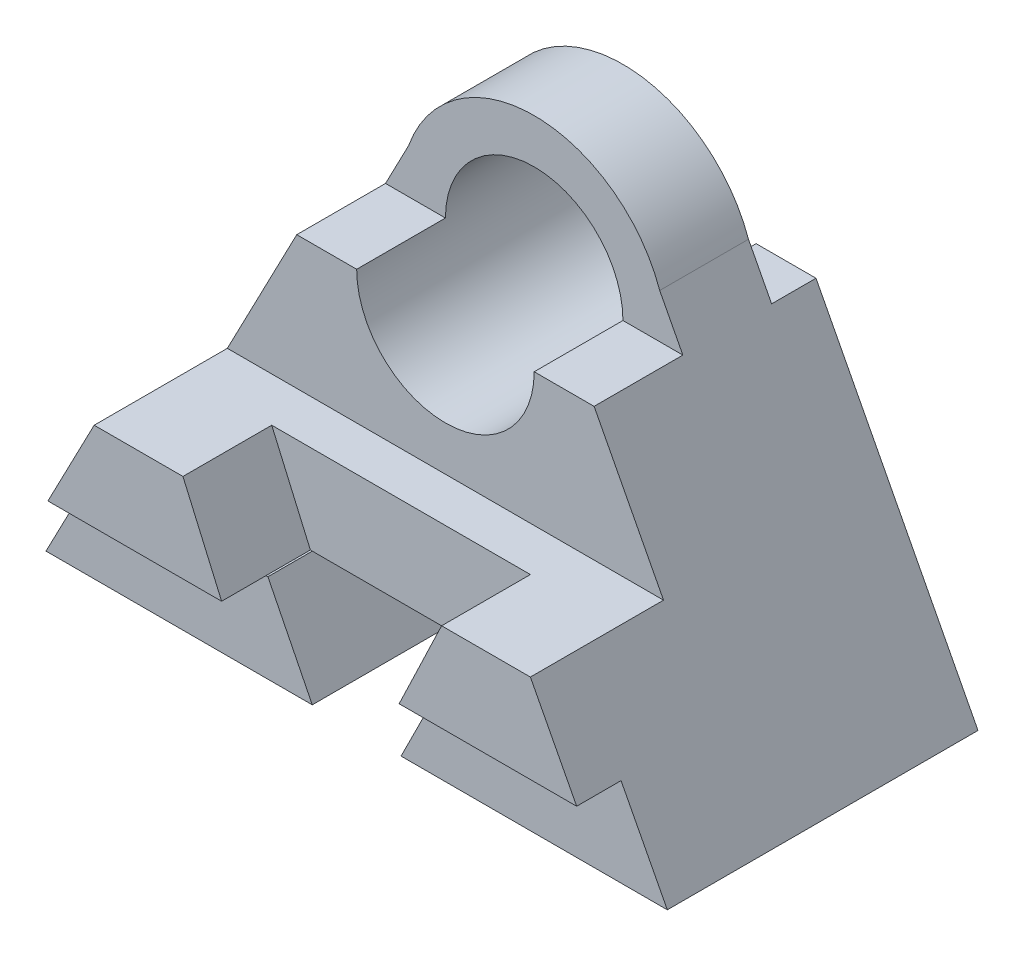
ISO-10303-21;
HEADER;
FILE_DESCRIPTION(('STEP AP214'),'2;1');
FILE_NAME('part.step','',(''),(''),'','','');
FILE_SCHEMA(('AUTOMOTIVE_DESIGN { 1 0 10303 214 1 1 1 1 }'));
ENDSEC;
DATA;
#1=APPLICATION_CONTEXT('core data for automotive mechanical design processes');
#2=APPLICATION_PROTOCOL_DEFINITION('international standard','automotive_design',2000,#1);
#3=PRODUCT_CONTEXT('',#1,'mechanical');
#4=PRODUCT('Part','Part','',(#3));
#5=PRODUCT_RELATED_PRODUCT_CATEGORY('part','',(#4));
#6=PRODUCT_DEFINITION_FORMATION('','',#4);
#7=PRODUCT_DEFINITION_CONTEXT('part definition',#1,'design');
#8=PRODUCT_DEFINITION('design','',#6,#7);
#9=PRODUCT_DEFINITION_SHAPE('','',#8);
#10=(LENGTH_UNIT() NAMED_UNIT(*) SI_UNIT(.MILLI.,.METRE.));
#11=(NAMED_UNIT(*) PLANE_ANGLE_UNIT() SI_UNIT($,.RADIAN.));
#12=(NAMED_UNIT(*) SI_UNIT($,.STERADIAN.) SOLID_ANGLE_UNIT());
#13=UNCERTAINTY_MEASURE_WITH_UNIT(LENGTH_MEASURE(1.E-05),#10,'distance_accuracy_value','');
#14=(GEOMETRIC_REPRESENTATION_CONTEXT(3) GLOBAL_UNCERTAINTY_ASSIGNED_CONTEXT((#13)) GLOBAL_UNIT_ASSIGNED_CONTEXT((#10,
#11,#12)) REPRESENTATION_CONTEXT('',''));
#15=CARTESIAN_POINT('',(0.,0.,0.));
#16=DIRECTION('',(0.,0.,1.));
#17=DIRECTION('',(1.,0.,0.));
#18=AXIS2_PLACEMENT_3D('',#15,#16,#17);
#19=CARTESIAN_POINT('',(-14.,2.,8.));
#20=DIRECTION('',(0.,-1.,0.));
#21=DIRECTION('',(0.,0.,-1.));
#22=AXIS2_PLACEMENT_3D('',#19,#20,#21);
#23=PLANE('',#22);
#24=DIRECTION('',(0.,0.,1.));
#25=VECTOR('',#24,1.);
#26=CARTESIAN_POINT('',(-9.04289321881345,2.,6.));
#27=LINE('',#26,#25);
#28=CARTESIAN_POINT('',(-9.04289321881345,2.,7.));
#29=VERTEX_POINT('',#28);
#30=CARTESIAN_POINT('',(-9.04289321881345,2.,8.));
#31=VERTEX_POINT('',#30);
#32=EDGE_CURVE('E377',#29,#31,#27,.T.);
#33=ORIENTED_EDGE('',*,*,#32,.T.);
#34=DIRECTION('',(1.,0.,0.));
#35=VECTOR('',#34,1.);
#36=CARTESIAN_POINT('',(-14.,2.,8.));
#37=LINE('',#36,#35);
#38=CARTESIAN_POINT('',(-12.9571067811865,2.,8.));
#39=VERTEX_POINT('',#38);
#40=EDGE_CURVE('E486',#39,#31,#37,.T.);
#41=ORIENTED_EDGE('',*,*,#40,.F.);
#42=DIRECTION('',(0.,0.,1.));
#43=VECTOR('',#42,1.);
#44=CARTESIAN_POINT('',(-12.9571067811865,2.,8.));
#45=LINE('',#44,#43);
#46=CARTESIAN_POINT('',(-12.9571067811865,2.,7.));
#47=VERTEX_POINT('',#46);
#48=EDGE_CURVE('E402',#47,#39,#45,.T.);
#49=ORIENTED_EDGE('',*,*,#48,.F.);
#50=DIRECTION('',(1.,0.,0.));
#51=VECTOR('',#50,1.);
#52=CARTESIAN_POINT('',(-14.,2.,7.));
#53=LINE('',#52,#51);
#54=EDGE_CURVE('E482',#47,#29,#53,.T.);
#55=ORIENTED_EDGE('',*,*,#54,.T.);
#56=EDGE_LOOP('',(#33,#41,#49,#55));
#57=FACE_BOUND('',#56,.T.);
#58=ADVANCED_FACE('F183',(#57),#23,.T.);
#59=CARTESIAN_POINT('',(-14.,4.,8.));
#60=DIRECTION('',(0.,0.,1.));
#61=DIRECTION('',(1.,0.,0.));
#62=AXIS2_PLACEMENT_3D('',#59,#60,#61);
#63=PLANE('',#62);
#64=DIRECTION('',(0.431670229113991,0.902031492408483,0.));
#65=VECTOR('',#64,1.);
#66=CARTESIAN_POINT('',(-5.04289321881345,2.,8.));
#67=LINE('',#66,#65);
#68=CARTESIAN_POINT('',(-5.04289321881345,2.,8.));
#69=VERTEX_POINT('',#68);
#70=CARTESIAN_POINT('',(-4.0857864376269,4.,8.));
#71=VERTEX_POINT('',#70);
#72=EDGE_CURVE('E370',#69,#71,#67,.T.);
#73=ORIENTED_EDGE('',*,*,#72,.F.);
#74=CARTESIAN_POINT('',(-1.04289321881345,2.,8.));
#75=VERTEX_POINT('',#74);
#76=EDGE_CURVE('E489',#69,#75,#37,.T.);
#77=ORIENTED_EDGE('',*,*,#76,.T.);
#78=DIRECTION('',(0.462362116591506,-0.886691193787906,0.));
#79=VECTOR('',#78,1.);
#80=CARTESIAN_POINT('',(0.,0.,8.));
#81=LINE('',#80,#79);
#82=CARTESIAN_POINT('',(-2.0857864376269,4.,8.));
#83=VERTEX_POINT('',#82);
#84=EDGE_CURVE('E425',#83,#75,#81,.T.);
#85=ORIENTED_EDGE('',*,*,#84,.F.);
#86=DIRECTION('',(1.,0.,0.));
#87=VECTOR('',#86,1.);
#88=CARTESIAN_POINT('',(-14.,4.,8.));
#89=LINE('',#88,#87);
#90=EDGE_CURVE('E491',#71,#83,#89,.T.);
#91=ORIENTED_EDGE('',*,*,#90,.F.);
#92=EDGE_LOOP('',(#73,#77,#85,#91));
#93=FACE_BOUND('',#92,.T.);
#94=ADVANCED_FACE('F559',(#93),#63,.T.);
#95=CARTESIAN_POINT('',(-14.,10.,3.));
#96=DIRECTION('',(0.,0.,1.));
#97=DIRECTION('',(0.,-1.,0.));
#98=AXIS2_PLACEMENT_3D('',#95,#96,#97);
#99=PLANE('',#98);
#100=DIRECTION('',(0.462362116591506,0.886691193787906,0.));
#101=VECTOR('',#100,1.);
#102=CARTESIAN_POINT('',(-9.90027582877174,7.86221273141022,3.));
#103=LINE('',#102,#101);
#104=CARTESIAN_POINT('',(-10.3498737341529,7.,3.));
#105=VERTEX_POINT('',#104);
#106=CARTESIAN_POINT('',(-9.82842712474619,8.,3.));
#107=VERTEX_POINT('',#106);
#108=EDGE_CURVE('E399',#105,#107,#103,.T.);
#109=ORIENTED_EDGE('',*,*,#108,.F.);
#110=DIRECTION('',(1.,0.,0.));
#111=VECTOR('',#110,1.);
#112=CARTESIAN_POINT('',(-14.,7.,3.));
#113=LINE('',#112,#111);
#114=CARTESIAN_POINT('',(-9.,7.,3.));
#115=VERTEX_POINT('',#114);
#116=EDGE_CURVE('E497',#105,#115,#113,.T.);
#117=ORIENTED_EDGE('',*,*,#116,.T.);
#118=CARTESIAN_POINT('',(-7.,7.,3.));
#119=DIRECTION('',(0.,0.,1.));
#120=DIRECTION('',(0.,-1.,0.));
#121=AXIS2_PLACEMENT_3D('',#118,#119,#120);
#122=CIRCLE('',#121,2.);
#123=CARTESIAN_POINT('',(-5.,7.,3.));
#124=VERTEX_POINT('',#123);
#125=EDGE_CURVE('E455',#124,#115,#122,.T.);
#126=ORIENTED_EDGE('',*,*,#125,.F.);
#127=CARTESIAN_POINT('',(-3.65012626584708,7.,3.));
#128=VERTEX_POINT('',#127);
#129=EDGE_CURVE('E499',#124,#128,#113,.T.);
#130=ORIENTED_EDGE('',*,*,#129,.T.);
#131=DIRECTION('',(0.462362116591506,-0.886691193787906,0.));
#132=VECTOR('',#131,1.);
#133=CARTESIAN_POINT('',(-7.09262634725394,13.6018265711298,3.));
#134=LINE('',#133,#132);
#135=CARTESIAN_POINT('',(-4.17157287525381,8.,3.));
#136=VERTEX_POINT('',#135);
#137=EDGE_CURVE('E434',#136,#128,#134,.T.);
#138=ORIENTED_EDGE('',*,*,#137,.F.);
#139=CARTESIAN_POINT('',(-7.,7.,3.));
#140=DIRECTION('',(0.,0.,1.));
#141=DIRECTION('',(0.,-1.,0.));
#142=AXIS2_PLACEMENT_3D('',#139,#140,#141);
#143=CIRCLE('',#142,3.);
#144=EDGE_CURVE('E469',#107,#136,#143,.F.);
#145=ORIENTED_EDGE('',*,*,#144,.F.);
#146=EDGE_LOOP('',(#109,#117,#126,#130,#138,#145));
#147=FACE_BOUND('',#146,.T.);
#148=ADVANCED_FACE('F581',(#147),#99,.T.);
#149=CARTESIAN_POINT('',(-14.,7.,1.));
#150=DIRECTION('',(0.,0.,-1.));
#151=DIRECTION('',(-1.,0.,0.));
#152=AXIS2_PLACEMENT_3D('',#149,#150,#151);
#153=PLANE('',#152);
#154=DIRECTION('',(-0.462362116591506,-0.886691193787906,0.));
#155=VECTOR('',#154,1.);
#156=CARTESIAN_POINT('',(-11.1301930801402,5.50354891198716,1.));
#157=LINE('',#156,#155);
#158=CARTESIAN_POINT('',(-9.82842712474619,8.,1.));
#159=VERTEX_POINT('',#158);
#160=CARTESIAN_POINT('',(-10.3498737341529,7.,1.));
#161=VERTEX_POINT('',#160);
#162=EDGE_CURVE('E410',#159,#161,#157,.T.);
#163=ORIENTED_EDGE('',*,*,#162,.F.);
#164=CARTESIAN_POINT('',(-7.,7.,1.));
#165=DIRECTION('',(0.,0.,-1.));
#166=DIRECTION('',(-1.,0.,0.));
#167=AXIS2_PLACEMENT_3D('',#164,#165,#166);
#168=CIRCLE('',#167,3.);
#169=CARTESIAN_POINT('',(-4.17157287525381,8.,1.));
#170=VERTEX_POINT('',#169);
#171=EDGE_CURVE('E12',#170,#159,#168,.F.);
#172=ORIENTED_EDGE('',*,*,#171,.F.);
#173=DIRECTION('',(-0.462362116591506,0.886691193787906,0.));
#174=VECTOR('',#173,1.);
#175=CARTESIAN_POINT('',(-5.86270909588547,11.2431627517067,1.));
#176=LINE('',#175,#174);
#177=CARTESIAN_POINT('',(-3.65012626584709,7.,1.));
#178=VERTEX_POINT('',#177);
#179=EDGE_CURVE('E432',#178,#170,#176,.T.);
#180=ORIENTED_EDGE('',*,*,#179,.F.);
#181=DIRECTION('',(1.,0.,0.));
#182=VECTOR('',#181,1.);
#183=CARTESIAN_POINT('',(-14.,7.,1.));
#184=LINE('',#183,#182);
#185=CARTESIAN_POINT('',(-5.,7.,1.));
#186=VERTEX_POINT('',#185);
#187=EDGE_CURVE('E502',#186,#178,#184,.T.);
#188=ORIENTED_EDGE('',*,*,#187,.F.);
#189=CARTESIAN_POINT('',(-7.,7.,1.));
#190=DIRECTION('',(0.,0.,-1.));
#191=DIRECTION('',(-1.,0.,0.));
#192=AXIS2_PLACEMENT_3D('',#189,#190,#191);
#193=CIRCLE('',#192,2.);
#194=CARTESIAN_POINT('',(-9.,7.,1.));
#195=VERTEX_POINT('',#194);
#196=EDGE_CURVE('E453',#195,#186,#193,.T.);
#197=ORIENTED_EDGE('',*,*,#196,.F.);
#198=EDGE_CURVE('E500',#161,#195,#184,.T.);
#199=ORIENTED_EDGE('',*,*,#198,.F.);
#200=EDGE_LOOP('',(#163,#172,#180,#188,#197,#199));
#201=FACE_BOUND('',#200,.T.);
#202=ADVANCED_FACE('F598',(#201),#153,.T.);
#203=CARTESIAN_POINT('',(-14.,0.,7.));
#204=DIRECTION('',(0.,-1.,0.));
#205=DIRECTION('',(0.,0.,-1.));
#206=AXIS2_PLACEMENT_3D('',#203,#204,#205);
#207=PLANE('',#206);
#208=DIRECTION('',(1.,0.,0.));
#209=VECTOR('',#208,1.);
#210=CARTESIAN_POINT('',(-14.,0.,0.));
#211=LINE('',#210,#209);
#212=CARTESIAN_POINT('',(-14.,0.,0.));
#213=VERTEX_POINT('',#212);
#214=CARTESIAN_POINT('',(-8.,0.,0.));
#215=VERTEX_POINT('',#214);
#216=EDGE_CURVE('E506',#213,#215,#211,.T.);
#217=ORIENTED_EDGE('',*,*,#216,.T.);
#218=DIRECTION('',(0.,0.,1.));
#219=VECTOR('',#218,1.);
#220=CARTESIAN_POINT('',(-8.,0.,-6.));
#221=LINE('',#220,#219);
#222=CARTESIAN_POINT('',(-8.,0.,7.));
#223=VERTEX_POINT('',#222);
#224=EDGE_CURVE('E412',#215,#223,#221,.T.);
#225=ORIENTED_EDGE('',*,*,#224,.T.);
#226=DIRECTION('',(1.,0.,0.));
#227=VECTOR('',#226,1.);
#228=CARTESIAN_POINT('',(-14.,0.,7.));
#229=LINE('',#228,#227);
#230=CARTESIAN_POINT('',(-14.,0.,7.));
#231=VERTEX_POINT('',#230);
#232=EDGE_CURVE('E477',#231,#223,#229,.T.);
#233=ORIENTED_EDGE('',*,*,#232,.F.);
#234=DIRECTION('',(0.,0.,-1.));
#235=VECTOR('',#234,1.);
#236=CARTESIAN_POINT('',(-14.,0.,7.));
#237=LINE('',#236,#235);
#238=EDGE_CURVE('E472',#231,#213,#237,.T.);
#239=ORIENTED_EDGE('',*,*,#238,.T.);
#240=EDGE_LOOP('',(#217,#225,#233,#239));
#241=FACE_BOUND('',#240,.T.);
#242=ADVANCED_FACE('F185',(#241),#207,.T.);
#243=CARTESIAN_POINT('',(-6.,0.,7.));
#244=VERTEX_POINT('',#243);
#245=CARTESIAN_POINT('',(0.,0.,7.));
#246=VERTEX_POINT('',#245);
#247=EDGE_CURVE('E481',#244,#246,#229,.T.);
#248=ORIENTED_EDGE('',*,*,#247,.F.);
#249=DIRECTION('',(0.,0.,1.));
#250=VECTOR('',#249,1.);
#251=CARTESIAN_POINT('',(-6.,0.,-6.));
#252=LINE('',#251,#250);
#253=CARTESIAN_POINT('',(-6.,0.,0.));
#254=VERTEX_POINT('',#253);
#255=EDGE_CURVE('E413',#254,#244,#252,.T.);
#256=ORIENTED_EDGE('',*,*,#255,.F.);
#257=CARTESIAN_POINT('',(0.,0.,0.));
#258=VERTEX_POINT('',#257);
#259=EDGE_CURVE('E475',#254,#258,#211,.T.);
#260=ORIENTED_EDGE('',*,*,#259,.T.);
#261=DIRECTION('',(0.,0.,-1.));
#262=VECTOR('',#261,1.);
#263=CARTESIAN_POINT('',(0.,0.,7.));
#264=LINE('',#263,#262);
#265=EDGE_CURVE('E471',#246,#258,#264,.T.);
#266=ORIENTED_EDGE('',*,*,#265,.F.);
#267=EDGE_LOOP('',(#248,#256,#260,#266));
#268=FACE_BOUND('',#267,.T.);
#269=ADVANCED_FACE('F622',(#268),#207,.T.);
#270=CARTESIAN_POINT('',(-14.,2.,7.));
#271=DIRECTION('',(0.,0.,1.));
#272=DIRECTION('',(1.,0.,0.));
#273=AXIS2_PLACEMENT_3D('',#270,#271,#272);
#274=PLANE('',#273);
#275=DIRECTION('',(0.462362116591506,0.886691193787906,0.));
#276=VECTOR('',#275,1.);
#277=CARTESIAN_POINT('',(-13.1800551657543,1.57244254628204,7.));
#278=LINE('',#277,#276);
#279=EDGE_CURVE('E404',#231,#47,#278,.T.);
#280=ORIENTED_EDGE('',*,*,#279,.F.);
#281=ORIENTED_EDGE('',*,*,#232,.T.);
#282=DIRECTION('',(-0.447213595499958,0.894427190999916,0.));
#283=VECTOR('',#282,1.);
#284=CARTESIAN_POINT('',(-10.,4.,7.));
#285=LINE('',#284,#283);
#286=CARTESIAN_POINT('',(-9.,2.,7.));
#287=VERTEX_POINT('',#286);
#288=EDGE_CURVE('E466',#223,#287,#285,.T.);
#289=ORIENTED_EDGE('',*,*,#288,.T.);
#290=DIRECTION('',(1.,0.,0.));
#291=VECTOR('',#290,1.);
#292=CARTESIAN_POINT('',(-14.,2.,7.));
#293=LINE('',#292,#291);
#294=EDGE_CURVE('E385',#29,#287,#293,.T.);
#295=ORIENTED_EDGE('',*,*,#294,.F.);
#296=ORIENTED_EDGE('',*,*,#54,.F.);
#297=EDGE_LOOP('',(#280,#281,#289,#295,#296));
#298=FACE_BOUND('',#297,.T.);
#299=ADVANCED_FACE('F531',(#298),#274,.T.);
#300=CARTESIAN_POINT('',(-5.,2.,7.));
#301=VERTEX_POINT('',#300);
#302=CARTESIAN_POINT('',(-1.04289321881345,2.,7.));
#303=VERTEX_POINT('',#302);
#304=EDGE_CURVE('E485',#301,#303,#53,.T.);
#305=ORIENTED_EDGE('',*,*,#304,.F.);
#306=DIRECTION('',(-0.447213595499958,-0.894427190999916,0.));
#307=VECTOR('',#306,1.);
#308=CARTESIAN_POINT('',(-6.8,-1.6,7.));
#309=LINE('',#308,#307);
#310=EDGE_CURVE('E463',#301,#244,#309,.T.);
#311=ORIENTED_EDGE('',*,*,#310,.T.);
#312=ORIENTED_EDGE('',*,*,#247,.T.);
#313=DIRECTION('',(0.462362116591506,-0.886691193787906,0.));
#314=VECTOR('',#313,1.);
#315=CARTESIAN_POINT('',(-3.81284701027134,7.31205638600161,7.));
#316=LINE('',#315,#314);
#317=EDGE_CURVE('E446',#303,#246,#316,.T.);
#318=ORIENTED_EDGE('',*,*,#317,.F.);
#319=EDGE_LOOP('',(#305,#311,#312,#318));
#320=FACE_BOUND('',#319,.T.);
#321=ADVANCED_FACE('F627',(#320),#274,.T.);
#322=CARTESIAN_POINT('',(-14.,7.,3.));
#323=DIRECTION('',(0.,1.,0.));
#324=DIRECTION('',(0.,0.,1.));
#325=AXIS2_PLACEMENT_3D('',#322,#323,#324);
#326=PLANE('',#325);
#327=DIRECTION('',(0.,0.,-1.));
#328=VECTOR('',#327,1.);
#329=CARTESIAN_POINT('',(-10.3498737341529,7.,3.));
#330=LINE('',#329,#328);
#331=CARTESIAN_POINT('',(-10.3498737341529,7.,5.));
#332=VERTEX_POINT('',#331);
#333=EDGE_CURVE('E397',#332,#105,#330,.T.);
#334=ORIENTED_EDGE('',*,*,#333,.F.);
#335=DIRECTION('',(1.,0.,0.));
#336=VECTOR('',#335,1.);
#337=CARTESIAN_POINT('',(-14.,7.,5.));
#338=LINE('',#337,#336);
#339=CARTESIAN_POINT('',(-9.,7.,5.));
#340=VERTEX_POINT('',#339);
#341=EDGE_CURVE('E494',#332,#340,#338,.T.);
#342=ORIENTED_EDGE('',*,*,#341,.T.);
#343=DIRECTION('',(0.,0.,1.));
#344=VECTOR('',#343,1.);
#345=CARTESIAN_POINT('',(-9.,7.,-6.));
#346=LINE('',#345,#344);
#347=EDGE_CURVE('E458',#115,#340,#346,.T.);
#348=ORIENTED_EDGE('',*,*,#347,.F.);
#349=ORIENTED_EDGE('',*,*,#116,.F.);
#350=EDGE_LOOP('',(#334,#342,#348,#349));
#351=FACE_BOUND('',#350,.T.);
#352=ADVANCED_FACE('F578',(#351),#326,.T.);
#353=CARTESIAN_POINT('',(-14.,7.,0.));
#354=DIRECTION('',(0.,1.,0.));
#355=DIRECTION('',(0.,0.,1.));
#356=AXIS2_PLACEMENT_3D('',#353,#354,#355);
#357=PLANE('',#356);
#358=DIRECTION('',(0.,0.,-1.));
#359=VECTOR('',#358,1.);
#360=CARTESIAN_POINT('',(-10.3498737341529,7.,0.));
#361=LINE('',#360,#359);
#362=CARTESIAN_POINT('',(-10.3498737341529,7.,0.));
#363=VERTEX_POINT('',#362);
#364=EDGE_CURVE('E408',#161,#363,#361,.T.);
#365=ORIENTED_EDGE('',*,*,#364,.F.);
#366=ORIENTED_EDGE('',*,*,#198,.T.);
#367=DIRECTION('',(0.,0.,1.));
#368=VECTOR('',#367,1.);
#369=CARTESIAN_POINT('',(-9.,7.,-6.));
#370=LINE('',#369,#368);
#371=CARTESIAN_POINT('',(-9.,7.,0.));
#372=VERTEX_POINT('',#371);
#373=EDGE_CURVE('E450',#372,#195,#370,.T.);
#374=ORIENTED_EDGE('',*,*,#373,.F.);
#375=DIRECTION('',(1.,0.,0.));
#376=VECTOR('',#375,1.);
#377=CARTESIAN_POINT('',(-14.,7.,0.));
#378=LINE('',#377,#376);
#379=EDGE_CURVE('E503',#363,#372,#378,.T.);
#380=ORIENTED_EDGE('',*,*,#379,.F.);
#381=EDGE_LOOP('',(#365,#366,#374,#380));
#382=FACE_BOUND('',#381,.T.);
#383=ADVANCED_FACE('F606',(#382),#357,.T.);
#384=CARTESIAN_POINT('',(-14.,0.,0.));
#385=DIRECTION('',(0.,0.,-1.));
#386=DIRECTION('',(-1.,0.,0.));
#387=AXIS2_PLACEMENT_3D('',#384,#385,#386);
#388=PLANE('',#387);
#389=DIRECTION('',(-0.462362116591506,-0.886691193787906,0.));
#390=VECTOR('',#389,1.);
#391=CARTESIAN_POINT('',(-14.,0.,0.));
#392=LINE('',#391,#390);
#393=EDGE_CURVE('E406',#363,#213,#392,.T.);
#394=ORIENTED_EDGE('',*,*,#393,.F.);
#395=ORIENTED_EDGE('',*,*,#379,.T.);
#396=CARTESIAN_POINT('',(-7.,7.,0.));
#397=DIRECTION('',(0.,0.,-1.));
#398=DIRECTION('',(-1.,0.,0.));
#399=AXIS2_PLACEMENT_3D('',#396,#397,#398);
#400=CIRCLE('',#399,2.);
#401=CARTESIAN_POINT('',(-5.,7.,0.));
#402=VERTEX_POINT('',#401);
#403=EDGE_CURVE('E480',#402,#372,#400,.T.);
#404=ORIENTED_EDGE('',*,*,#403,.F.);
#405=CARTESIAN_POINT('',(-3.65012626584708,7.,0.));
#406=VERTEX_POINT('',#405);
#407=EDGE_CURVE('E505',#402,#406,#378,.T.);
#408=ORIENTED_EDGE('',*,*,#407,.T.);
#409=DIRECTION('',(-0.462362116591506,0.886691193787906,0.));
#410=VECTOR('',#409,1.);
#411=CARTESIAN_POINT('',(-2.99290217602569,5.73961383971956,0.));
#412=LINE('',#411,#410);
#413=EDGE_CURVE('E428',#258,#406,#412,.T.);
#414=ORIENTED_EDGE('',*,*,#413,.F.);
#415=ORIENTED_EDGE('',*,*,#259,.F.);
#416=DIRECTION('',(0.447213595499958,0.894427190999916,0.));
#417=VECTOR('',#416,1.);
#418=CARTESIAN_POINT('',(-7.6,-3.2,0.));
#419=LINE('',#418,#417);
#420=CARTESIAN_POINT('',(-5.,2.,0.));
#421=VERTEX_POINT('',#420);
#422=EDGE_CURVE('E511',#254,#421,#419,.T.);
#423=ORIENTED_EDGE('',*,*,#422,.T.);
#424=DIRECTION('',(-1.,0.,0.));
#425=VECTOR('',#424,1.);
#426=CARTESIAN_POINT('',(-14.,2.,0.));
#427=LINE('',#426,#425);
#428=CARTESIAN_POINT('',(-9.,2.,0.));
#429=VERTEX_POINT('',#428);
#430=EDGE_CURVE('E514',#421,#429,#427,.T.);
#431=ORIENTED_EDGE('',*,*,#430,.T.);
#432=DIRECTION('',(0.447213595499958,-0.894427190999916,0.));
#433=VECTOR('',#432,1.);
#434=CARTESIAN_POINT('',(-9.2,2.4,0.));
#435=LINE('',#434,#433);
#436=EDGE_CURVE('E191',#429,#215,#435,.T.);
#437=ORIENTED_EDGE('',*,*,#436,.T.);
#438=ORIENTED_EDGE('',*,*,#216,.F.);
#439=EDGE_LOOP('',(#394,#395,#404,#408,#414,#415,#423,#431,#437,#438));
#440=FACE_BOUND('',#439,.T.);
#441=ADVANCED_FACE('F520',(#440),#388,.T.);
#442=DIRECTION('',(0.,0.,1.));
#443=VECTOR('',#442,1.);
#444=CARTESIAN_POINT('',(-5.04289321881345,2.,6.));
#445=LINE('',#444,#443);
#446=CARTESIAN_POINT('',(-5.04289321881345,2.,6.));
#447=VERTEX_POINT('',#446);
#448=EDGE_CURVE('E543',#447,#69,#445,.T.);
#449=ORIENTED_EDGE('',*,*,#448,.F.);
#450=DIRECTION('',(1.,0.,0.));
#451=VECTOR('',#450,1.);
#452=CARTESIAN_POINT('',(-9.04289321881345,2.,6.));
#453=LINE('',#452,#451);
#454=CARTESIAN_POINT('',(-9.,2.,6.));
#455=VERTEX_POINT('',#454);
#456=EDGE_CURVE('E360',#455,#447,#453,.T.);
#457=ORIENTED_EDGE('',*,*,#456,.F.);
#458=DIRECTION('',(0.,0.,1.));
#459=VECTOR('',#458,1.);
#460=CARTESIAN_POINT('',(-9.,2.,-6.));
#461=LINE('',#460,#459);
#462=EDGE_CURVE('E417',#429,#455,#461,.T.);
#463=ORIENTED_EDGE('',*,*,#462,.F.);
#464=ORIENTED_EDGE('',*,*,#430,.F.);
#465=DIRECTION('',(0.,0.,1.));
#466=VECTOR('',#465,1.);
#467=CARTESIAN_POINT('',(-5.,2.,-6.));
#468=LINE('',#467,#466);
#469=EDGE_CURVE('E206',#421,#301,#468,.T.);
#470=ORIENTED_EDGE('',*,*,#469,.T.);
#471=ORIENTED_EDGE('',*,*,#304,.T.);
#472=DIRECTION('',(0.,0.,-1.));
#473=VECTOR('',#472,1.);
#474=CARTESIAN_POINT('',(-1.04289321881345,2.,8.));
#475=LINE('',#474,#473);
#476=EDGE_CURVE('E444',#75,#303,#475,.T.);
#477=ORIENTED_EDGE('',*,*,#476,.F.);
#478=ORIENTED_EDGE('',*,*,#76,.F.);
#479=EDGE_LOOP('',(#449,#457,#463,#464,#470,#471,#477,#478));
#480=FACE_BOUND('',#479,.T.);
#481=ADVANCED_FACE('F554',(#480),#23,.T.);
#482=DIRECTION('',(0.399402625379115,-0.916775622952678,0.));
#483=VECTOR('',#482,1.);
#484=CARTESIAN_POINT('',(-9.91421356237309,4.,8.));
#485=LINE('',#484,#483);
#486=CARTESIAN_POINT('',(-9.91421356237309,4.,8.));
#487=VERTEX_POINT('',#486);
#488=EDGE_CURVE('E538',#487,#31,#485,.T.);
#489=ORIENTED_EDGE('',*,*,#488,.F.);
#490=CARTESIAN_POINT('',(-11.9142135623731,4.,8.));
#491=VERTEX_POINT('',#490);
#492=EDGE_CURVE('E376',#491,#487,#89,.T.);
#493=ORIENTED_EDGE('',*,*,#492,.F.);
#494=DIRECTION('',(0.462362116591506,0.886691193787906,0.));
#495=VECTOR('',#494,1.);
#496=CARTESIAN_POINT('',(-11.0070978239743,5.73961383971956,8.));
#497=LINE('',#496,#495);
#498=EDGE_CURVE('E387',#39,#491,#497,.T.);
#499=ORIENTED_EDGE('',*,*,#498,.F.);
#500=ORIENTED_EDGE('',*,*,#40,.T.);
#501=EDGE_LOOP('',(#489,#493,#499,#500));
#502=FACE_BOUND('',#501,.T.);
#503=ADVANCED_FACE('F537',(#502),#63,.T.);
#504=CARTESIAN_POINT('',(-14.,4.,5.));
#505=DIRECTION('',(0.,1.,0.));
#506=DIRECTION('',(0.,0.,1.));
#507=AXIS2_PLACEMENT_3D('',#504,#505,#506);
#508=PLANE('',#507);
#509=DIRECTION('',(0.,0.,1.));
#510=VECTOR('',#509,1.);
#511=CARTESIAN_POINT('',(-4.0857864376269,4.,6.));
#512=LINE('',#511,#510);
#513=CARTESIAN_POINT('',(-4.0857864376269,4.,6.));
#514=VERTEX_POINT('',#513);
#515=EDGE_CURVE('E388',#514,#71,#512,.T.);
#516=ORIENTED_EDGE('',*,*,#515,.T.);
#517=ORIENTED_EDGE('',*,*,#90,.T.);
#518=DIRECTION('',(0.,0.,1.));
#519=VECTOR('',#518,1.);
#520=CARTESIAN_POINT('',(-2.08578643762691,4.,5.));
#521=LINE('',#520,#519);
#522=CARTESIAN_POINT('',(-2.0857864376269,4.,5.));
#523=VERTEX_POINT('',#522);
#524=EDGE_CURVE('E441',#523,#83,#521,.T.);
#525=ORIENTED_EDGE('',*,*,#524,.F.);
#526=DIRECTION('',(1.,0.,0.));
#527=VECTOR('',#526,1.);
#528=CARTESIAN_POINT('',(-14.,4.,5.));
#529=LINE('',#528,#527);
#530=CARTESIAN_POINT('',(-11.9142135623731,4.,5.));
#531=VERTEX_POINT('',#530);
#532=EDGE_CURVE('E492',#531,#523,#529,.T.);
#533=ORIENTED_EDGE('',*,*,#532,.F.);
#534=DIRECTION('',(0.,0.,-1.));
#535=VECTOR('',#534,1.);
#536=CARTESIAN_POINT('',(-11.9142135623731,4.,5.));
#537=LINE('',#536,#535);
#538=EDGE_CURVE('E395',#491,#531,#537,.T.);
#539=ORIENTED_EDGE('',*,*,#538,.F.);
#540=ORIENTED_EDGE('',*,*,#492,.T.);
#541=DIRECTION('',(0.,0.,1.));
#542=VECTOR('',#541,1.);
#543=CARTESIAN_POINT('',(-9.91421356237309,4.,6.));
#544=LINE('',#543,#542);
#545=CARTESIAN_POINT('',(-9.91421356237309,4.,6.));
#546=VERTEX_POINT('',#545);
#547=EDGE_CURVE('E353',#546,#487,#544,.T.);
#548=ORIENTED_EDGE('',*,*,#547,.F.);
#549=DIRECTION('',(-1.,0.,0.));
#550=VECTOR('',#549,1.);
#551=CARTESIAN_POINT('',(-4.0857864376269,4.,6.));
#552=LINE('',#551,#550);
#553=EDGE_CURVE('E361',#514,#546,#552,.T.);
#554=ORIENTED_EDGE('',*,*,#553,.F.);
#555=EDGE_LOOP('',(#516,#517,#525,#533,#539,#540,#548,#554));
#556=FACE_BOUND('',#555,.T.);
#557=ADVANCED_FACE('F373',(#556),#508,.T.);
#558=CARTESIAN_POINT('',(-14.,7.,5.));
#559=DIRECTION('',(0.,0.,1.));
#560=DIRECTION('',(1.,0.,0.));
#561=AXIS2_PLACEMENT_3D('',#558,#559,#560);
#562=PLANE('',#561);
#563=DIRECTION('',(0.462362116591506,0.886691193787906,0.));
#564=VECTOR('',#563,1.);
#565=CARTESIAN_POINT('',(-11.1301930801402,5.50354891198716,5.));
#566=LINE('',#565,#564);
#567=EDGE_CURVE('E393',#531,#332,#566,.T.);
#568=ORIENTED_EDGE('',*,*,#567,.F.);
#569=ORIENTED_EDGE('',*,*,#532,.T.);
#570=DIRECTION('',(0.462362116591506,-0.886691193787906,0.));
#571=VECTOR('',#570,1.);
#572=CARTESIAN_POINT('',(-5.86270909588547,11.2431627517067,5.));
#573=LINE('',#572,#571);
#574=CARTESIAN_POINT('',(-3.65012626584708,7.,5.));
#575=VERTEX_POINT('',#574);
#576=EDGE_CURVE('E438',#575,#523,#573,.T.);
#577=ORIENTED_EDGE('',*,*,#576,.F.);
#578=CARTESIAN_POINT('',(-5.,7.,5.));
#579=VERTEX_POINT('',#578);
#580=EDGE_CURVE('E496',#579,#575,#338,.T.);
#581=ORIENTED_EDGE('',*,*,#580,.F.);
#582=CARTESIAN_POINT('',(-7.,7.,5.));
#583=DIRECTION('',(0.,0.,1.));
#584=DIRECTION('',(1.,0.,0.));
#585=AXIS2_PLACEMENT_3D('',#582,#583,#584);
#586=CIRCLE('',#585,2.);
#587=EDGE_CURVE('E461',#340,#579,#586,.T.);
#588=ORIENTED_EDGE('',*,*,#587,.F.);
#589=ORIENTED_EDGE('',*,*,#341,.F.);
#590=EDGE_LOOP('',(#568,#569,#577,#581,#588,#589));
#591=FACE_BOUND('',#590,.T.);
#592=ADVANCED_FACE('F569',(#591),#562,.T.);
#593=DIRECTION('',(0.,0.,1.));
#594=VECTOR('',#593,1.);
#595=CARTESIAN_POINT('',(-5.,7.,-6.));
#596=LINE('',#595,#594);
#597=EDGE_CURVE('E198',#579,#124,#596,.F.);
#598=ORIENTED_EDGE('',*,*,#597,.F.);
#599=ORIENTED_EDGE('',*,*,#580,.T.);
#600=DIRECTION('',(0.,0.,1.));
#601=VECTOR('',#600,1.);
#602=CARTESIAN_POINT('',(-3.65012626584708,7.,3.));
#603=LINE('',#602,#601);
#604=EDGE_CURVE('E436',#128,#575,#603,.T.);
#605=ORIENTED_EDGE('',*,*,#604,.F.);
#606=ORIENTED_EDGE('',*,*,#129,.F.);
#607=EDGE_LOOP('',(#598,#599,#605,#606));
#608=FACE_BOUND('',#607,.T.);
#609=ADVANCED_FACE('F588',(#608),#326,.T.);
#610=DIRECTION('',(0.,0.,1.));
#611=VECTOR('',#610,1.);
#612=CARTESIAN_POINT('',(-5.,7.,-6.));
#613=LINE('',#612,#611);
#614=EDGE_CURVE('E448',#186,#402,#613,.F.);
#615=ORIENTED_EDGE('',*,*,#614,.F.);
#616=ORIENTED_EDGE('',*,*,#187,.T.);
#617=DIRECTION('',(0.,0.,1.));
#618=VECTOR('',#617,1.);
#619=CARTESIAN_POINT('',(-3.65012626584709,7.,0.));
#620=LINE('',#619,#618);
#621=EDGE_CURVE('E430',#406,#178,#620,.T.);
#622=ORIENTED_EDGE('',*,*,#621,.F.);
#623=ORIENTED_EDGE('',*,*,#407,.F.);
#624=EDGE_LOOP('',(#615,#616,#622,#623));
#625=FACE_BOUND('',#624,.T.);
#626=ADVANCED_FACE('F613',(#625),#357,.T.);
#627=CARTESIAN_POINT('',(0.,0.,-6.));
#628=DIRECTION('',(-0.886691193787906,-0.462362116591506,0.));
#629=DIRECTION('',(0.462362116591506,-0.886691193787906,0.));
#630=AXIS2_PLACEMENT_3D('',#627,#628,#629);
#631=PLANE('',#630);
#632=ORIENTED_EDGE('',*,*,#317,.T.);
#633=ORIENTED_EDGE('',*,*,#265,.T.);
#634=ORIENTED_EDGE('',*,*,#413,.T.);
#635=ORIENTED_EDGE('',*,*,#621,.T.);
#636=ORIENTED_EDGE('',*,*,#179,.T.);
#637=DIRECTION('',(0.,0.,1.));
#638=VECTOR('',#637,1.);
#639=CARTESIAN_POINT('',(-4.17157287525381,8.,-6.));
#640=LINE('',#639,#638);
#641=EDGE_CURVE('E415',#170,#136,#640,.T.);
#642=ORIENTED_EDGE('',*,*,#641,.T.);
#643=ORIENTED_EDGE('',*,*,#137,.T.);
#644=ORIENTED_EDGE('',*,*,#604,.T.);
#645=ORIENTED_EDGE('',*,*,#576,.T.);
#646=ORIENTED_EDGE('',*,*,#524,.T.);
#647=ORIENTED_EDGE('',*,*,#84,.T.);
#648=ORIENTED_EDGE('',*,*,#476,.T.);
#649=EDGE_LOOP('',(#632,#633,#634,#635,#636,#642,#643,#644,#645,#646,#647,#648));
#650=FACE_BOUND('',#649,.T.);
#651=ADVANCED_FACE('F562',(#650),#631,.F.);
#652=CARTESIAN_POINT('',(-7.,7.,-6.));
#653=DIRECTION('',(0.,0.,1.));
#654=DIRECTION('',(1.,0.,0.));
#655=AXIS2_PLACEMENT_3D('',#652,#653,#654);
#656=CYLINDRICAL_SURFACE('',#655,3.);
#657=ORIENTED_EDGE('',*,*,#144,.T.);
#658=ORIENTED_EDGE('',*,*,#641,.F.);
#659=ORIENTED_EDGE('',*,*,#171,.T.);
#660=DIRECTION('',(0.,0.,1.));
#661=VECTOR('',#660,1.);
#662=CARTESIAN_POINT('',(-9.82842712474619,8.,-6.));
#663=LINE('',#662,#661);
#664=EDGE_CURVE('E390',#159,#107,#663,.T.);
#665=ORIENTED_EDGE('',*,*,#664,.T.);
#666=EDGE_LOOP('',(#657,#658,#659,#665));
#667=FACE_BOUND('',#666,.T.);
#668=ADVANCED_FACE('F594',(#667),#656,.T.);
#669=CARTESIAN_POINT('',(-7.,7.,-6.));
#670=DIRECTION('',(0.,0.,1.));
#671=DIRECTION('',(1.,0.,0.));
#672=AXIS2_PLACEMENT_3D('',#669,#670,#671);
#673=CYLINDRICAL_SURFACE('',#672,2.);
#674=ORIENTED_EDGE('',*,*,#587,.T.);
#675=ORIENTED_EDGE('',*,*,#597,.T.);
#676=ORIENTED_EDGE('',*,*,#125,.T.);
#677=ORIENTED_EDGE('',*,*,#347,.T.);
#678=EDGE_LOOP('',(#674,#675,#676,#677));
#679=FACE_BOUND('',#678,.T.);
#680=ORIENTED_EDGE('',*,*,#196,.T.);
#681=ORIENTED_EDGE('',*,*,#614,.T.);
#682=ORIENTED_EDGE('',*,*,#403,.T.);
#683=ORIENTED_EDGE('',*,*,#373,.T.);
#684=EDGE_LOOP('',(#680,#681,#682,#683));
#685=FACE_BOUND('',#684,.T.);
#686=ADVANCED_FACE('F584',(#679,#685),#673,.F.);
#687=CARTESIAN_POINT('',(-6.4,-3.2,-6.));
#688=DIRECTION('',(0.894427190999916,0.447213595499958,0.));
#689=DIRECTION('',(-0.447213595499958,0.894427190999916,0.));
#690=AXIS2_PLACEMENT_3D('',#687,#688,#689);
#691=PLANE('',#690);
#692=ORIENTED_EDGE('',*,*,#224,.F.);
#693=ORIENTED_EDGE('',*,*,#436,.F.);
#694=ORIENTED_EDGE('',*,*,#462,.T.);
#695=EDGE_CURVE('E420',#455,#287,#461,.T.);
#696=ORIENTED_EDGE('',*,*,#695,.T.);
#697=ORIENTED_EDGE('',*,*,#288,.F.);
#698=EDGE_LOOP('',(#692,#693,#694,#696,#697));
#699=FACE_BOUND('',#698,.T.);
#700=ADVANCED_FACE('F628',(#699),#691,.T.);
#701=CARTESIAN_POINT('',(-4.8,2.4,-6.));
#702=DIRECTION('',(-0.894427190999916,0.447213595499958,0.));
#703=DIRECTION('',(-0.447213595499958,-0.894427190999916,0.));
#704=AXIS2_PLACEMENT_3D('',#701,#702,#703);
#705=PLANE('',#704);
#706=ORIENTED_EDGE('',*,*,#469,.F.);
#707=ORIENTED_EDGE('',*,*,#422,.F.);
#708=ORIENTED_EDGE('',*,*,#255,.T.);
#709=ORIENTED_EDGE('',*,*,#310,.F.);
#710=EDGE_LOOP('',(#706,#707,#708,#709));
#711=FACE_BOUND('',#710,.T.);
#712=ADVANCED_FACE('F624',(#711),#705,.T.);
#713=CARTESIAN_POINT('',(-11.0070978239743,5.73961383971956,-6.));
#714=DIRECTION('',(0.886691193787906,-0.462362116591506,0.));
#715=DIRECTION('',(0.462362116591506,0.886691193787906,0.));
#716=AXIS2_PLACEMENT_3D('',#713,#714,#715);
#717=PLANE('',#716);
#718=ORIENTED_EDGE('',*,*,#162,.T.);
#719=ORIENTED_EDGE('',*,*,#364,.T.);
#720=ORIENTED_EDGE('',*,*,#393,.T.);
#721=ORIENTED_EDGE('',*,*,#238,.F.);
#722=ORIENTED_EDGE('',*,*,#279,.T.);
#723=ORIENTED_EDGE('',*,*,#48,.T.);
#724=ORIENTED_EDGE('',*,*,#498,.T.);
#725=ORIENTED_EDGE('',*,*,#538,.T.);
#726=ORIENTED_EDGE('',*,*,#567,.T.);
#727=ORIENTED_EDGE('',*,*,#333,.T.);
#728=ORIENTED_EDGE('',*,*,#108,.T.);
#729=ORIENTED_EDGE('',*,*,#664,.F.);
#730=EDGE_LOOP('',(#718,#719,#720,#721,#722,#723,#724,#725,#726,#727,#728,#729));
#731=FACE_BOUND('',#730,.T.);
#732=ADVANCED_FACE('F527',(#731),#717,.F.);
#733=CARTESIAN_POINT('',(-5.04289321881345,2.,6.));
#734=DIRECTION('',(0.902031492408483,-0.431670229113991,0.));
#735=DIRECTION('',(0.431670229113991,0.902031492408483,0.));
#736=AXIS2_PLACEMENT_3D('',#733,#734,#735);
#737=PLANE('',#736);
#738=ORIENTED_EDGE('',*,*,#72,.T.);
#739=ORIENTED_EDGE('',*,*,#515,.F.);
#740=DIRECTION('',(0.431670229113991,0.902031492408483,0.));
#741=VECTOR('',#740,1.);
#742=CARTESIAN_POINT('',(-5.04289321881345,2.,6.));
#743=LINE('',#742,#741);
#744=EDGE_CURVE('E367',#447,#514,#743,.T.);
#745=ORIENTED_EDGE('',*,*,#744,.F.);
#746=ORIENTED_EDGE('',*,*,#448,.T.);
#747=EDGE_LOOP('',(#738,#739,#745,#746));
#748=FACE_BOUND('',#747,.T.);
#749=ADVANCED_FACE('F552',(#748),#737,.F.);
#750=CARTESIAN_POINT('',(-9.04289321881345,2.,6.));
#751=DIRECTION('',(0.,-1.,0.));
#752=DIRECTION('',(1.,0.,0.));
#753=AXIS2_PLACEMENT_3D('',#750,#751,#752);
#754=PLANE('',#753);
#755=ORIENTED_EDGE('',*,*,#294,.T.);
#756=ORIENTED_EDGE('',*,*,#695,.F.);
#757=CARTESIAN_POINT('',(-9.04289321881345,2.,6.));
#758=VERTEX_POINT('',#757);
#759=EDGE_CURVE('E381',#758,#455,#453,.T.);
#760=ORIENTED_EDGE('',*,*,#759,.F.);
#761=EDGE_CURVE('E356',#758,#29,#27,.T.);
#762=ORIENTED_EDGE('',*,*,#761,.T.);
#763=EDGE_LOOP('',(#755,#756,#760,#762));
#764=FACE_BOUND('',#763,.T.);
#765=ADVANCED_FACE('F548',(#764),#754,.F.);
#766=CARTESIAN_POINT('',(-9.91421356237309,4.,6.));
#767=DIRECTION('',(-0.916775622952678,-0.399402625379115,0.));
#768=DIRECTION('',(0.399402625379115,-0.916775622952678,0.));
#769=AXIS2_PLACEMENT_3D('',#766,#767,#768);
#770=PLANE('',#769);
#771=ORIENTED_EDGE('',*,*,#488,.T.);
#772=ORIENTED_EDGE('',*,*,#32,.F.);
#773=ORIENTED_EDGE('',*,*,#761,.F.);
#774=DIRECTION('',(0.399402625379115,-0.916775622952678,0.));
#775=VECTOR('',#774,1.);
#776=CARTESIAN_POINT('',(-9.91421356237309,4.,6.));
#777=LINE('',#776,#775);
#778=EDGE_CURVE('E349',#546,#758,#777,.T.);
#779=ORIENTED_EDGE('',*,*,#778,.F.);
#780=ORIENTED_EDGE('',*,*,#547,.T.);
#781=EDGE_LOOP('',(#771,#772,#773,#779,#780));
#782=FACE_BOUND('',#781,.T.);
#783=ADVANCED_FACE('F351',(#782),#770,.F.);
#784=CARTESIAN_POINT('',(0.,0.,6.));
#785=DIRECTION('',(0.,0.,1.));
#786=DIRECTION('',(1.,0.,0.));
#787=AXIS2_PLACEMENT_3D('',#784,#785,#786);
#788=PLANE('',#787);
#789=ORIENTED_EDGE('',*,*,#553,.T.);
#790=ORIENTED_EDGE('',*,*,#778,.T.);
#791=ORIENTED_EDGE('',*,*,#759,.T.);
#792=ORIENTED_EDGE('',*,*,#456,.T.);
#793=ORIENTED_EDGE('',*,*,#744,.T.);
#794=EDGE_LOOP('',(#789,#790,#791,#792,#793));
#795=FACE_BOUND('',#794,.T.);
#796=ADVANCED_FACE('F365',(#795),#788,.T.);
#797=CLOSED_SHELL('',(#58,#94,#148,#202,#242,#269,#299,#321,#352,#383,#441,#481,#503,#557,#592,
#609,#626,#651,#668,#686,#700,#712,#732,#749,#765,#783,#796));
#798=MANIFOLD_SOLID_BREP('B2',#797);
#799=ADVANCED_BREP_SHAPE_REPRESENTATION('',(#18,#798),#14);
#800=SHAPE_DEFINITION_REPRESENTATION(#9,#799);
ENDSEC;
END-ISO-10303-21;
